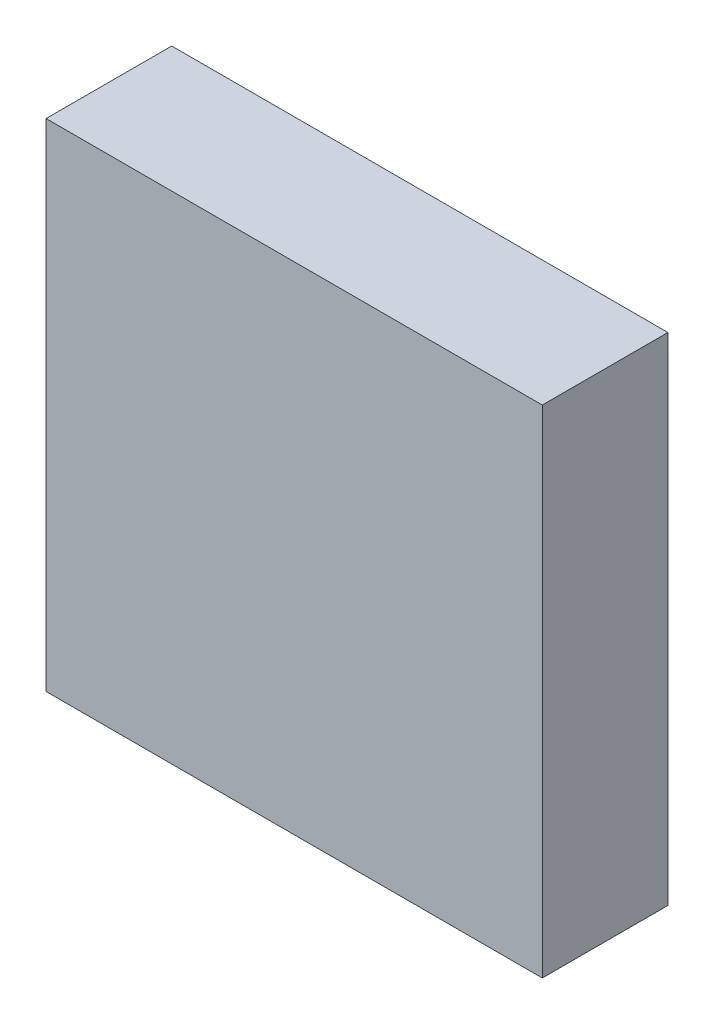
ISO-10303-21;
HEADER;
FILE_DESCRIPTION(('STEP AP214'),'2;1');
FILE_NAME('part.step','',(''),(''),'','','');
FILE_SCHEMA(('AUTOMOTIVE_DESIGN { 1 0 10303 214 1 1 1 1 }'));
ENDSEC;
DATA;
#1=APPLICATION_CONTEXT('core data for automotive mechanical design processes');
#2=APPLICATION_PROTOCOL_DEFINITION('international standard','automotive_design',2000,#1);
#3=PRODUCT_CONTEXT('',#1,'mechanical');
#4=PRODUCT('Part','Part','',(#3));
#5=PRODUCT_RELATED_PRODUCT_CATEGORY('part','',(#4));
#6=PRODUCT_DEFINITION_FORMATION('','',#4);
#7=PRODUCT_DEFINITION_CONTEXT('part definition',#1,'design');
#8=PRODUCT_DEFINITION('design','',#6,#7);
#9=PRODUCT_DEFINITION_SHAPE('','',#8);
#10=(LENGTH_UNIT() NAMED_UNIT(*) SI_UNIT(.MILLI.,.METRE.));
#11=(NAMED_UNIT(*) PLANE_ANGLE_UNIT() SI_UNIT($,.RADIAN.));
#12=(NAMED_UNIT(*) SI_UNIT($,.STERADIAN.) SOLID_ANGLE_UNIT());
#13=UNCERTAINTY_MEASURE_WITH_UNIT(LENGTH_MEASURE(1.E-05),#10,'distance_accuracy_value','');
#14=(GEOMETRIC_REPRESENTATION_CONTEXT(3) GLOBAL_UNCERTAINTY_ASSIGNED_CONTEXT((#13)) GLOBAL_UNIT_ASSIGNED_CONTEXT((#10,
#11,#12)) REPRESENTATION_CONTEXT('',''));
#15=CARTESIAN_POINT('',(0.,0.,0.));
#16=DIRECTION('',(0.,0.,1.));
#17=DIRECTION('',(1.,0.,0.));
#18=AXIS2_PLACEMENT_3D('',#15,#16,#17);
#19=CARTESIAN_POINT('',(62.411864,44.014136,1.74752));
#20=DIRECTION('',(0.,0.,1.));
#21=DIRECTION('',(0.,1.,0.));
#22=AXIS2_PLACEMENT_3D('',#19,#20,#21);
#23=PLANE('',#22);
#24=DIRECTION('',(1.,0.,0.));
#25=VECTOR('',#24,1.);
#26=CARTESIAN_POINT('',(60.325,48.1076,1.74752));
#27=LINE('',#26,#25);
#28=CARTESIAN_POINT('',(62.3316,48.1076,1.74752));
#29=VERTEX_POINT('',#28);
#30=CARTESIAN_POINT('',(58.3184,48.1076,1.74752));
#31=VERTEX_POINT('',#30);
#32=EDGE_CURVE('E76',#29,#31,#27,.F.);
#33=ORIENTED_EDGE('',*,*,#32,.T.);
#34=DIRECTION('',(0.,1.,0.));
#35=VECTOR('',#34,1.);
#36=CARTESIAN_POINT('',(58.3184,46.101,1.74752));
#37=LINE('',#36,#35);
#38=CARTESIAN_POINT('',(58.3184,44.0944,1.74752));
#39=VERTEX_POINT('',#38);
#40=EDGE_CURVE('E58',#31,#39,#37,.F.);
#41=ORIENTED_EDGE('',*,*,#40,.T.);
#42=DIRECTION('',(-1.,0.,0.));
#43=VECTOR('',#42,1.);
#44=CARTESIAN_POINT('',(60.325,44.0944,1.74752));
#45=LINE('',#44,#43);
#46=CARTESIAN_POINT('',(62.3316,44.0944,1.74752));
#47=VERTEX_POINT('',#46);
#48=EDGE_CURVE('E20',#39,#47,#45,.F.);
#49=ORIENTED_EDGE('',*,*,#48,.T.);
#50=DIRECTION('',(0.,-1.,0.));
#51=VECTOR('',#50,1.);
#52=CARTESIAN_POINT('',(62.3316,46.101,1.74752));
#53=LINE('',#52,#51);
#54=EDGE_CURVE('E55',#47,#29,#53,.F.);
#55=ORIENTED_EDGE('',*,*,#54,.T.);
#56=EDGE_LOOP('',(#33,#41,#49,#55));
#57=FACE_BOUND('',#56,.T.);
#58=ADVANCED_FACE('F16',(#57),#23,.T.);
#59=CARTESIAN_POINT('',(58.238136,44.0944,0.7112));
#60=DIRECTION('',(0.,-1.,0.));
#61=DIRECTION('',(1.,0.,0.));
#62=AXIS2_PLACEMENT_3D('',#59,#60,#61);
#63=PLANE('',#62);
#64=ORIENTED_EDGE('',*,*,#48,.F.);
#65=DIRECTION('',(0.,0.,1.));
#66=VECTOR('',#65,1.);
#67=CARTESIAN_POINT('',(58.3184,44.0944,1.23952));
#68=LINE('',#67,#66);
#69=CARTESIAN_POINT('',(58.3184,44.0944,0.73152));
#70=VERTEX_POINT('',#69);
#71=EDGE_CURVE('E80',#39,#70,#68,.F.);
#72=ORIENTED_EDGE('',*,*,#71,.T.);
#73=DIRECTION('',(1.,0.,0.));
#74=VECTOR('',#73,1.);
#75=CARTESIAN_POINT('',(60.325,44.0944,0.73152));
#76=LINE('',#75,#74);
#77=CARTESIAN_POINT('',(62.3316,44.0944,0.73152));
#78=VERTEX_POINT('',#77);
#79=EDGE_CURVE('E73',#70,#78,#76,.T.);
#80=ORIENTED_EDGE('',*,*,#79,.T.);
#81=DIRECTION('',(0.,0.,-1.));
#82=VECTOR('',#81,1.);
#83=CARTESIAN_POINT('',(62.3316,44.0944,1.23952));
#84=LINE('',#83,#82);
#85=EDGE_CURVE('E63',#78,#47,#84,.F.);
#86=ORIENTED_EDGE('',*,*,#85,.T.);
#87=EDGE_LOOP('',(#64,#72,#80,#86));
#88=FACE_BOUND('',#87,.T.);
#89=ADVANCED_FACE('F72',(#88),#63,.T.);
#90=CARTESIAN_POINT('',(62.3316,44.014136,0.7112));
#91=DIRECTION('',(1.,0.,0.));
#92=DIRECTION('',(0.,1.,0.));
#93=AXIS2_PLACEMENT_3D('',#90,#91,#92);
#94=PLANE('',#93);
#95=ORIENTED_EDGE('',*,*,#54,.F.);
#96=ORIENTED_EDGE('',*,*,#85,.F.);
#97=DIRECTION('',(0.,1.,0.));
#98=VECTOR('',#97,1.);
#99=CARTESIAN_POINT('',(62.3316,46.101,0.73152));
#100=LINE('',#99,#98);
#101=CARTESIAN_POINT('',(62.3316,48.1076,0.73152));
#102=VERTEX_POINT('',#101);
#103=EDGE_CURVE('E83',#78,#102,#100,.T.);
#104=ORIENTED_EDGE('',*,*,#103,.T.);
#105=DIRECTION('',(0.,0.,-1.));
#106=VECTOR('',#105,1.);
#107=CARTESIAN_POINT('',(62.3316,48.1076,1.23952));
#108=LINE('',#107,#106);
#109=EDGE_CURVE('E69',#102,#29,#108,.F.);
#110=ORIENTED_EDGE('',*,*,#109,.T.);
#111=EDGE_LOOP('',(#95,#96,#104,#110));
#112=FACE_BOUND('',#111,.T.);
#113=ADVANCED_FACE('F66',(#112),#94,.T.);
#114=CARTESIAN_POINT('',(62.411864,48.1076,0.7112));
#115=DIRECTION('',(0.,1.,0.));
#116=DIRECTION('',(-1.,0.,0.));
#117=AXIS2_PLACEMENT_3D('',#114,#115,#116);
#118=PLANE('',#117);
#119=ORIENTED_EDGE('',*,*,#32,.F.);
#120=ORIENTED_EDGE('',*,*,#109,.F.);
#121=DIRECTION('',(-1.,0.,0.));
#122=VECTOR('',#121,1.);
#123=CARTESIAN_POINT('',(60.325,48.1076,0.73152));
#124=LINE('',#123,#122);
#125=CARTESIAN_POINT('',(58.3184,48.1076,0.73152));
#126=VERTEX_POINT('',#125);
#127=EDGE_CURVE('E26',#102,#126,#124,.T.);
#128=ORIENTED_EDGE('',*,*,#127,.T.);
#129=DIRECTION('',(0.,0.,-1.));
#130=VECTOR('',#129,1.);
#131=CARTESIAN_POINT('',(58.3184,48.1076,1.23952));
#132=LINE('',#131,#130);
#133=EDGE_CURVE('E34',#126,#31,#132,.F.);
#134=ORIENTED_EDGE('',*,*,#133,.T.);
#135=EDGE_LOOP('',(#119,#120,#128,#134));
#136=FACE_BOUND('',#135,.T.);
#137=ADVANCED_FACE('F88',(#136),#118,.T.);
#138=CARTESIAN_POINT('',(58.3184,48.187864,0.7112));
#139=DIRECTION('',(-1.,0.,0.));
#140=DIRECTION('',(0.,-1.,0.));
#141=AXIS2_PLACEMENT_3D('',#138,#139,#140);
#142=PLANE('',#141);
#143=ORIENTED_EDGE('',*,*,#40,.F.);
#144=ORIENTED_EDGE('',*,*,#133,.F.);
#145=DIRECTION('',(0.,-1.,0.));
#146=VECTOR('',#145,1.);
#147=CARTESIAN_POINT('',(58.3184,46.101,0.73152));
#148=LINE('',#147,#146);
#149=EDGE_CURVE('E11',#126,#70,#148,.T.);
#150=ORIENTED_EDGE('',*,*,#149,.T.);
#151=ORIENTED_EDGE('',*,*,#71,.F.);
#152=EDGE_LOOP('',(#143,#144,#150,#151));
#153=FACE_BOUND('',#152,.T.);
#154=ADVANCED_FACE('F90',(#153),#142,.T.);
#155=CARTESIAN_POINT('',(62.411864,44.014136,0.73152));
#156=DIRECTION('',(0.,0.,1.));
#157=DIRECTION('',(0.,1.,0.));
#158=AXIS2_PLACEMENT_3D('',#155,#156,#157);
#159=PLANE('',#158);
#160=ORIENTED_EDGE('',*,*,#127,.F.);
#161=ORIENTED_EDGE('',*,*,#103,.F.);
#162=ORIENTED_EDGE('',*,*,#79,.F.);
#163=ORIENTED_EDGE('',*,*,#149,.F.);
#164=EDGE_LOOP('',(#160,#161,#162,#163));
#165=FACE_BOUND('',#164,.T.);
#166=ADVANCED_FACE('F18',(#165),#159,.F.);
#167=CLOSED_SHELL('',(#58,#89,#113,#137,#154,#166));
#168=MANIFOLD_SOLID_BREP('B1',#167);
#169=ADVANCED_BREP_SHAPE_REPRESENTATION('',(#18,#168),#14);
#170=SHAPE_DEFINITION_REPRESENTATION(#9,#169);
ENDSEC;
END-ISO-10303-21;
